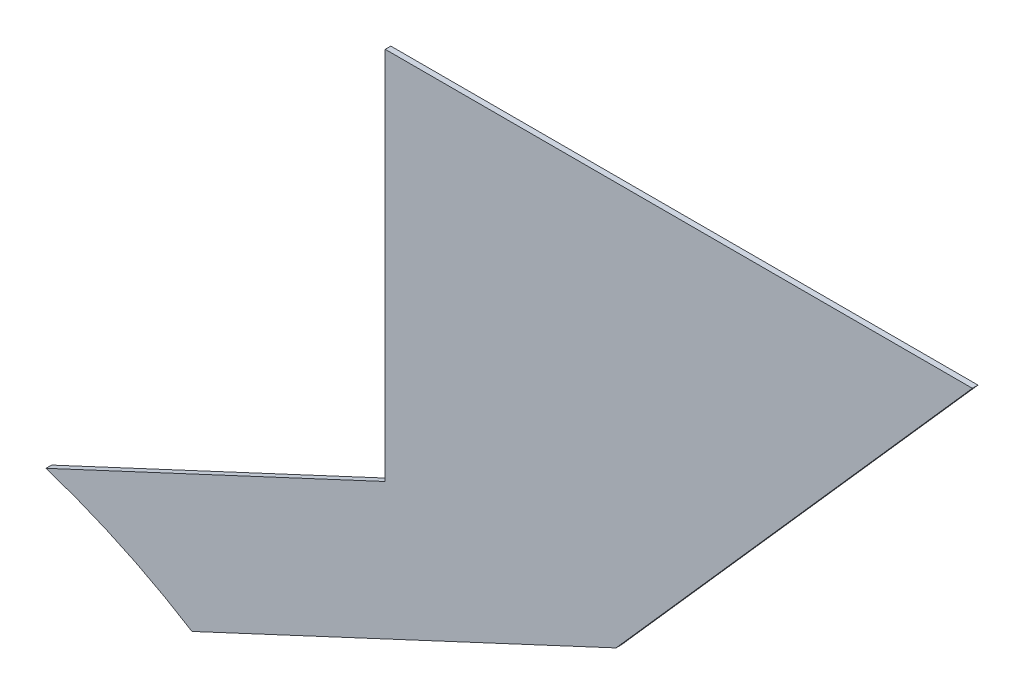
ISO-10303-21;
HEADER;
FILE_DESCRIPTION(('STEP AP214'),'2;1');
FILE_NAME('part.step','',(''),(''),'','','');
FILE_SCHEMA(('AUTOMOTIVE_DESIGN { 1 0 10303 214 1 1 1 1 }'));
ENDSEC;
DATA;
#1=APPLICATION_CONTEXT('core data for automotive mechanical design processes');
#2=APPLICATION_PROTOCOL_DEFINITION('international standard','automotive_design',2000,#1);
#3=PRODUCT_CONTEXT('',#1,'mechanical');
#4=PRODUCT('Part','Part','',(#3));
#5=PRODUCT_RELATED_PRODUCT_CATEGORY('part','',(#4));
#6=PRODUCT_DEFINITION_FORMATION('','',#4);
#7=PRODUCT_DEFINITION_CONTEXT('part definition',#1,'design');
#8=PRODUCT_DEFINITION('design','',#6,#7);
#9=PRODUCT_DEFINITION_SHAPE('','',#8);
#10=(LENGTH_UNIT() NAMED_UNIT(*) SI_UNIT(.MILLI.,.METRE.));
#11=(NAMED_UNIT(*) PLANE_ANGLE_UNIT() SI_UNIT($,.RADIAN.));
#12=(NAMED_UNIT(*) SI_UNIT($,.STERADIAN.) SOLID_ANGLE_UNIT());
#13=UNCERTAINTY_MEASURE_WITH_UNIT(LENGTH_MEASURE(1.E-05),#10,'distance_accuracy_value','');
#14=(GEOMETRIC_REPRESENTATION_CONTEXT(3) GLOBAL_UNCERTAINTY_ASSIGNED_CONTEXT((#13)) GLOBAL_UNIT_ASSIGNED_CONTEXT((#10,
#11,#12)) REPRESENTATION_CONTEXT('',''));
#15=CARTESIAN_POINT('',(0.,0.,0.));
#16=DIRECTION('',(0.,0.,1.));
#17=DIRECTION('',(1.,0.,0.));
#18=AXIS2_PLACEMENT_3D('',#15,#16,#17);
#19=CARTESIAN_POINT('',(0.,0.,1.51892));
#20=DIRECTION('',(0.,0.,-1.));
#21=DIRECTION('',(-1.,0.,0.));
#22=AXIS2_PLACEMENT_3D('',#19,#20,#21);
#23=CYLINDRICAL_SURFACE('',#22,179.31892);
#24=CARTESIAN_POINT('',(0.,0.,0.));
#25=DIRECTION('',(0.,0.,-1.));
#26=DIRECTION('',(1.,0.,0.));
#27=AXIS2_PLACEMENT_3D('',#24,#25,#26);
#28=CIRCLE('',#27,179.31892);
#29=CARTESIAN_POINT('',(55.63108,170.471282062405,0.));
#30=VERTEX_POINT('',#29);
#31=CARTESIAN_POINT('',(95.25,151.929959421986,0.));
#32=VERTEX_POINT('',#31);
#33=EDGE_CURVE('E122',#30,#32,#28,.T.);
#34=ORIENTED_EDGE('',*,*,#33,.T.);
#35=DIRECTION('',(0.,0.,-1.));
#36=VECTOR('',#35,1.);
#37=CARTESIAN_POINT('',(95.25,151.929959421986,1.51892));
#38=LINE('',#37,#36);
#39=CARTESIAN_POINT('',(95.25,151.929959421986,1.51892));
#40=VERTEX_POINT('',#39);
#41=EDGE_CURVE('E11',#40,#32,#38,.T.);
#42=ORIENTED_EDGE('',*,*,#41,.F.);
#43=CARTESIAN_POINT('',(0.,0.,1.51892));
#44=DIRECTION('',(0.,0.,-1.));
#45=DIRECTION('',(1.,0.,0.));
#46=AXIS2_PLACEMENT_3D('',#43,#44,#45);
#47=CIRCLE('',#46,179.31892);
#48=CARTESIAN_POINT('',(55.63108,170.471282062405,1.51892));
#49=VERTEX_POINT('',#48);
#50=EDGE_CURVE('E132',#49,#40,#47,.T.);
#51=ORIENTED_EDGE('',*,*,#50,.F.);
#52=DIRECTION('',(0.,0.,-1.));
#53=VECTOR('',#52,1.);
#54=CARTESIAN_POINT('',(55.63108,170.471282062405,1.51892));
#55=LINE('',#54,#53);
#56=EDGE_CURVE('E118',#49,#30,#55,.T.);
#57=ORIENTED_EDGE('',*,*,#56,.T.);
#58=EDGE_LOOP('',(#34,#42,#51,#57));
#59=FACE_BOUND('',#58,.T.);
#60=ADVANCED_FACE('F38',(#59),#23,.F.);
#61=CARTESIAN_POINT('',(210.351088953655,205.602478663055,1.51892));
#62=DIRECTION('',(-0.422618261740697,0.906307787036651,0.));
#63=DIRECTION('',(-0.906307787036651,-0.422618261740697,0.));
#64=AXIS2_PLACEMENT_3D('',#61,#62,#63);
#65=PLANE('',#64);
#66=DIRECTION('',(0.906307787036651,0.422618261740697,0.));
#67=VECTOR('',#66,1.);
#68=CARTESIAN_POINT('',(210.351088953655,205.602478663055,0.));
#69=LINE('',#68,#67);
#70=CARTESIAN_POINT('',(210.351088953655,205.602478663055,0.));
#71=VERTEX_POINT('',#70);
#72=EDGE_CURVE('E125',#32,#71,#69,.T.);
#73=ORIENTED_EDGE('',*,*,#72,.T.);
#74=DIRECTION('',(0.,0.,-1.));
#75=VECTOR('',#74,1.);
#76=CARTESIAN_POINT('',(210.351088953655,205.602478663055,1.51892));
#77=LINE('',#76,#75);
#78=CARTESIAN_POINT('',(210.351088953655,205.602478663055,1.51892));
#79=VERTEX_POINT('',#78);
#80=EDGE_CURVE('E46',#79,#71,#77,.T.);
#81=ORIENTED_EDGE('',*,*,#80,.F.);
#82=DIRECTION('',(0.906307787036651,0.422618261740697,0.));
#83=VECTOR('',#82,1.);
#84=CARTESIAN_POINT('',(210.351088953655,205.602478663055,1.51892));
#85=LINE('',#84,#83);
#86=EDGE_CURVE('E91',#40,#79,#85,.T.);
#87=ORIENTED_EDGE('',*,*,#86,.F.);
#88=ORIENTED_EDGE('',*,*,#41,.T.);
#89=EDGE_LOOP('',(#73,#81,#87,#88));
#90=FACE_BOUND('',#89,.T.);
#91=ADVANCED_FACE('F156',(#90),#65,.F.);
#92=CARTESIAN_POINT('',(307.102060534149,315.00929745526,1.51892));
#93=DIRECTION('',(-0.749105229662478,0.662451020749705,0.));
#94=DIRECTION('',(-0.662451020749705,-0.749105229662478,0.));
#95=AXIS2_PLACEMENT_3D('',#92,#93,#94);
#96=PLANE('',#95);
#97=DIRECTION('',(0.662451020749705,0.749105229662478,0.));
#98=VECTOR('',#97,1.);
#99=CARTESIAN_POINT('',(307.102060534149,315.00929745526,0.));
#100=LINE('',#99,#98);
#101=CARTESIAN_POINT('',(307.102060534149,315.00929745526,0.));
#102=VERTEX_POINT('',#101);
#103=EDGE_CURVE('E127',#71,#102,#100,.T.);
#104=ORIENTED_EDGE('',*,*,#103,.T.);
#105=DIRECTION('',(0.,0.,-1.));
#106=VECTOR('',#105,1.);
#107=CARTESIAN_POINT('',(307.102060534149,315.00929745526,1.51892));
#108=LINE('',#107,#106);
#109=CARTESIAN_POINT('',(307.102060534149,315.00929745526,1.51892));
#110=VERTEX_POINT('',#109);
#111=EDGE_CURVE('E113',#110,#102,#108,.T.);
#112=ORIENTED_EDGE('',*,*,#111,.F.);
#113=DIRECTION('',(0.662451020749705,0.749105229662478,0.));
#114=VECTOR('',#113,1.);
#115=CARTESIAN_POINT('',(307.102060534149,315.00929745526,1.51892));
#116=LINE('',#115,#114);
#117=EDGE_CURVE('E104',#79,#110,#116,.T.);
#118=ORIENTED_EDGE('',*,*,#117,.F.);
#119=ORIENTED_EDGE('',*,*,#80,.T.);
#120=EDGE_LOOP('',(#104,#112,#118,#119));
#121=FACE_BOUND('',#120,.T.);
#122=ADVANCED_FACE('F138',(#121),#96,.F.);
#123=CARTESIAN_POINT('',(147.711951162924,315.00929745526,1.51892));
#124=DIRECTION('',(0.,-1.,0.));
#125=DIRECTION('',(1.,0.,0.));
#126=AXIS2_PLACEMENT_3D('',#123,#124,#125);
#127=PLANE('',#126);
#128=DIRECTION('',(-1.,0.,0.));
#129=VECTOR('',#128,1.);
#130=CARTESIAN_POINT('',(147.711951162924,315.00929745526,0.));
#131=LINE('',#130,#129);
#132=CARTESIAN_POINT('',(147.711951162924,315.00929745526,0.));
#133=VERTEX_POINT('',#132);
#134=EDGE_CURVE('E112',#102,#133,#131,.T.);
#135=ORIENTED_EDGE('',*,*,#134,.T.);
#136=DIRECTION('',(0.,0.,-1.));
#137=VECTOR('',#136,1.);
#138=CARTESIAN_POINT('',(147.711951162924,315.00929745526,1.51892));
#139=LINE('',#138,#137);
#140=CARTESIAN_POINT('',(147.711951162924,315.00929745526,1.51892));
#141=VERTEX_POINT('',#140);
#142=EDGE_CURVE('E109',#141,#133,#139,.T.);
#143=ORIENTED_EDGE('',*,*,#142,.F.);
#144=DIRECTION('',(-1.,0.,0.));
#145=VECTOR('',#144,1.);
#146=CARTESIAN_POINT('',(147.711951162924,315.00929745526,1.51892));
#147=LINE('',#146,#145);
#148=EDGE_CURVE('E98',#110,#141,#147,.T.);
#149=ORIENTED_EDGE('',*,*,#148,.F.);
#150=ORIENTED_EDGE('',*,*,#111,.T.);
#151=EDGE_LOOP('',(#135,#143,#149,#150));
#152=FACE_BOUND('',#151,.T.);
#153=ADVANCED_FACE('F110',(#152),#127,.F.);
#154=CARTESIAN_POINT('',(147.711951162924,213.40929745526,1.51892));
#155=DIRECTION('',(1.,0.,0.));
#156=DIRECTION('',(0.,1.,0.));
#157=AXIS2_PLACEMENT_3D('',#154,#155,#156);
#158=PLANE('',#157);
#159=DIRECTION('',(0.,-1.,0.));
#160=VECTOR('',#159,1.);
#161=CARTESIAN_POINT('',(147.711951162924,213.40929745526,0.));
#162=LINE('',#161,#160);
#163=CARTESIAN_POINT('',(147.711951162924,213.40929745526,0.));
#164=VERTEX_POINT('',#163);
#165=EDGE_CURVE('E77',#133,#164,#162,.T.);
#166=ORIENTED_EDGE('',*,*,#165,.T.);
#167=DIRECTION('',(0.,0.,-1.));
#168=VECTOR('',#167,1.);
#169=CARTESIAN_POINT('',(147.711951162924,213.40929745526,1.51892));
#170=LINE('',#169,#168);
#171=CARTESIAN_POINT('',(147.711951162924,213.40929745526,1.51892));
#172=VERTEX_POINT('',#171);
#173=EDGE_CURVE('E114',#172,#164,#170,.T.);
#174=ORIENTED_EDGE('',*,*,#173,.F.);
#175=DIRECTION('',(0.,-1.,0.));
#176=VECTOR('',#175,1.);
#177=CARTESIAN_POINT('',(147.711951162924,213.40929745526,1.51892));
#178=LINE('',#177,#176);
#179=EDGE_CURVE('E102',#141,#172,#178,.T.);
#180=ORIENTED_EDGE('',*,*,#179,.F.);
#181=ORIENTED_EDGE('',*,*,#142,.T.);
#182=EDGE_LOOP('',(#166,#174,#180,#181));
#183=FACE_BOUND('',#182,.T.);
#184=ADVANCED_FACE('F116',(#183),#158,.F.);
#185=CARTESIAN_POINT('',(55.63108,170.471282062405,1.51892));
#186=DIRECTION('',(0.422618261740697,-0.906307787036651,0.));
#187=DIRECTION('',(0.906307787036651,0.422618261740697,0.));
#188=AXIS2_PLACEMENT_3D('',#185,#186,#187);
#189=PLANE('',#188);
#190=DIRECTION('',(-0.906307787036651,-0.422618261740697,0.));
#191=VECTOR('',#190,1.);
#192=CARTESIAN_POINT('',(55.63108,170.471282062405,0.));
#193=LINE('',#192,#191);
#194=EDGE_CURVE('E83',#164,#30,#193,.T.);
#195=ORIENTED_EDGE('',*,*,#194,.T.);
#196=ORIENTED_EDGE('',*,*,#56,.F.);
#197=DIRECTION('',(-0.906307787036651,-0.422618261740697,0.));
#198=VECTOR('',#197,1.);
#199=CARTESIAN_POINT('',(55.63108,170.471282062405,1.51892));
#200=LINE('',#199,#198);
#201=EDGE_CURVE('E54',#172,#49,#200,.T.);
#202=ORIENTED_EDGE('',*,*,#201,.F.);
#203=ORIENTED_EDGE('',*,*,#173,.T.);
#204=EDGE_LOOP('',(#195,#196,#202,#203));
#205=FACE_BOUND('',#204,.T.);
#206=ADVANCED_FACE('F145',(#205),#189,.F.);
#207=CARTESIAN_POINT('',(0.,0.,1.51892));
#208=DIRECTION('',(0.,0.,1.));
#209=DIRECTION('',(1.,0.,0.));
#210=AXIS2_PLACEMENT_3D('',#207,#208,#209);
#211=PLANE('',#210);
#212=ORIENTED_EDGE('',*,*,#50,.T.);
#213=ORIENTED_EDGE('',*,*,#86,.T.);
#214=ORIENTED_EDGE('',*,*,#117,.T.);
#215=ORIENTED_EDGE('',*,*,#148,.T.);
#216=ORIENTED_EDGE('',*,*,#179,.T.);
#217=ORIENTED_EDGE('',*,*,#201,.T.);
#218=EDGE_LOOP('',(#212,#213,#214,#215,#216,#217));
#219=FACE_BOUND('',#218,.T.);
#220=ADVANCED_FACE('F100',(#219),#211,.T.);
#221=CARTESIAN_POINT('',(0.,0.,0.));
#222=DIRECTION('',(0.,0.,1.));
#223=DIRECTION('',(1.,0.,0.));
#224=AXIS2_PLACEMENT_3D('',#221,#222,#223);
#225=PLANE('',#224);
#226=ORIENTED_EDGE('',*,*,#33,.F.);
#227=ORIENTED_EDGE('',*,*,#194,.F.);
#228=ORIENTED_EDGE('',*,*,#165,.F.);
#229=ORIENTED_EDGE('',*,*,#134,.F.);
#230=ORIENTED_EDGE('',*,*,#103,.F.);
#231=ORIENTED_EDGE('',*,*,#72,.F.);
#232=EDGE_LOOP('',(#226,#227,#228,#229,#230,#231));
#233=FACE_BOUND('',#232,.T.);
#234=ADVANCED_FACE('F141',(#233),#225,.F.);
#235=CLOSED_SHELL('',(#60,#91,#122,#153,#184,#206,#220,#234));
#236=MANIFOLD_SOLID_BREP('B2',#235);
#237=ADVANCED_BREP_SHAPE_REPRESENTATION('',(#18,#236),#14);
#238=SHAPE_DEFINITION_REPRESENTATION(#9,#237);
ENDSEC;
END-ISO-10303-21;
